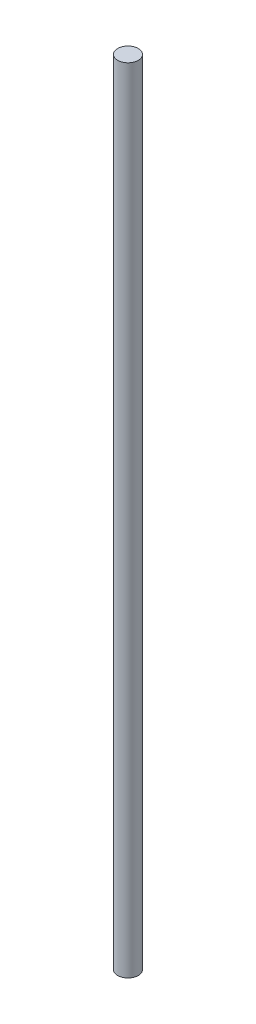
ISO-10303-21;
HEADER;
FILE_DESCRIPTION(('STEP AP214'),'2;1');
FILE_NAME('part.step','',(''),(''),'','','');
FILE_SCHEMA(('AUTOMOTIVE_DESIGN { 1 0 10303 214 1 1 1 1 }'));
ENDSEC;
DATA;
#1=APPLICATION_CONTEXT('core data for automotive mechanical design processes');
#2=APPLICATION_PROTOCOL_DEFINITION('international standard','automotive_design',2000,#1);
#3=PRODUCT_CONTEXT('',#1,'mechanical');
#4=PRODUCT('Part','Part','',(#3));
#5=PRODUCT_RELATED_PRODUCT_CATEGORY('part','',(#4));
#6=PRODUCT_DEFINITION_FORMATION('','',#4);
#7=PRODUCT_DEFINITION_CONTEXT('part definition',#1,'design');
#8=PRODUCT_DEFINITION('design','',#6,#7);
#9=PRODUCT_DEFINITION_SHAPE('','',#8);
#10=(LENGTH_UNIT() NAMED_UNIT(*) SI_UNIT(.MILLI.,.METRE.));
#11=(NAMED_UNIT(*) PLANE_ANGLE_UNIT() SI_UNIT($,.RADIAN.));
#12=(NAMED_UNIT(*) SI_UNIT($,.STERADIAN.) SOLID_ANGLE_UNIT());
#13=UNCERTAINTY_MEASURE_WITH_UNIT(LENGTH_MEASURE(1.E-05),#10,'distance_accuracy_value','');
#14=(GEOMETRIC_REPRESENTATION_CONTEXT(3) GLOBAL_UNCERTAINTY_ASSIGNED_CONTEXT((#13)) GLOBAL_UNIT_ASSIGNED_CONTEXT((#10,
#11,#12)) REPRESENTATION_CONTEXT('',''));
#15=CARTESIAN_POINT('',(0.,0.,0.));
#16=DIRECTION('',(0.,0.,1.));
#17=DIRECTION('',(1.,0.,0.));
#18=AXIS2_PLACEMENT_3D('',#15,#16,#17);
#19=CARTESIAN_POINT('',(0.,192.5,0.));
#20=DIRECTION('',(0.,-1.,0.));
#21=DIRECTION('',(0.,0.,-1.));
#22=AXIS2_PLACEMENT_3D('',#19,#20,#21);
#23=CYLINDRICAL_SURFACE('',#22,5.);
#24=CARTESIAN_POINT('',(0.,192.5,0.));
#25=DIRECTION('',(0.,1.,0.));
#26=DIRECTION('',(0.,0.,1.));
#27=AXIS2_PLACEMENT_3D('',#24,#25,#26);
#28=CIRCLE('',#27,5.);
#29=CARTESIAN_POINT('',(0.,192.5,5.));
#30=VERTEX_POINT('',#29);
#31=EDGE_CURVE('E10',#30,#30,#28,.T.);
#32=ORIENTED_EDGE('',*,*,#31,.F.);
#33=EDGE_LOOP('',(#32));
#34=FACE_BOUND('',#33,.T.);
#35=CARTESIAN_POINT('',(0.,-192.5,0.));
#36=DIRECTION('',(0.,1.,0.));
#37=DIRECTION('',(0.,0.,1.));
#38=AXIS2_PLACEMENT_3D('',#35,#36,#37);
#39=CIRCLE('',#38,5.);
#40=CARTESIAN_POINT('',(0.,-192.5,5.));
#41=VERTEX_POINT('',#40);
#42=EDGE_CURVE('E40',#41,#41,#39,.T.);
#43=ORIENTED_EDGE('',*,*,#42,.T.);
#44=EDGE_LOOP('',(#43));
#45=FACE_BOUND('',#44,.T.);
#46=ADVANCED_FACE('F37',(#34,#45),#23,.T.);
#47=CARTESIAN_POINT('',(0.,192.5,0.));
#48=DIRECTION('',(0.,1.,0.));
#49=DIRECTION('',(0.,0.,1.));
#50=AXIS2_PLACEMENT_3D('',#47,#48,#49);
#51=PLANE('',#50);
#52=ORIENTED_EDGE('',*,*,#31,.T.);
#53=EDGE_LOOP('',(#52));
#54=FACE_BOUND('',#53,.T.);
#55=ADVANCED_FACE('F54',(#54),#51,.T.);
#56=CARTESIAN_POINT('',(0.,-192.5,0.));
#57=DIRECTION('',(0.,1.,0.));
#58=DIRECTION('',(0.,0.,1.));
#59=AXIS2_PLACEMENT_3D('',#56,#57,#58);
#60=PLANE('',#59);
#61=ORIENTED_EDGE('',*,*,#42,.F.);
#62=EDGE_LOOP('',(#61));
#63=FACE_BOUND('',#62,.T.);
#64=ADVANCED_FACE('F52',(#63),#60,.F.);
#65=CLOSED_SHELL('',(#46,#55,#64));
#66=MANIFOLD_SOLID_BREP('B2',#65);
#67=ADVANCED_BREP_SHAPE_REPRESENTATION('',(#18,#66),#14);
#68=SHAPE_DEFINITION_REPRESENTATION(#9,#67);
ENDSEC;
END-ISO-10303-21;
